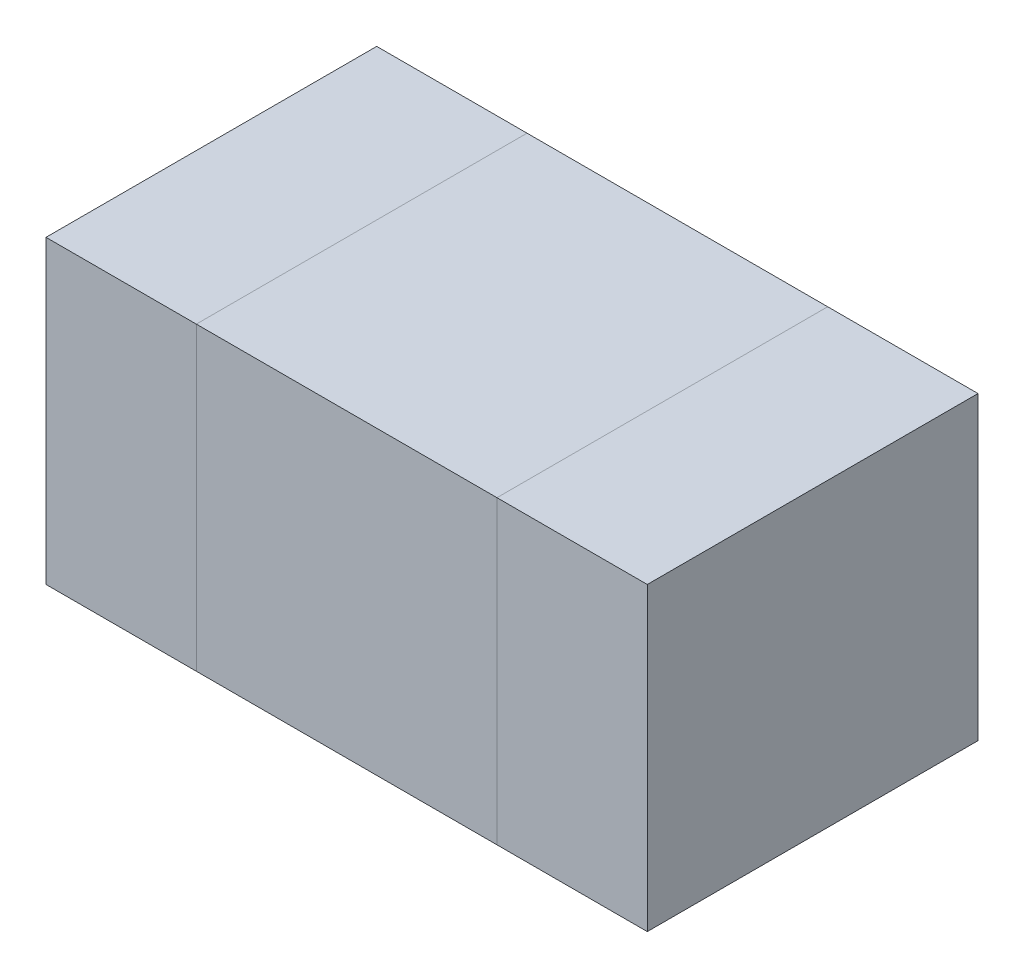
ISO-10303-21;
HEADER;
FILE_DESCRIPTION(('STEP AP214'),'2;1');
FILE_NAME('part.step','',(''),(''),'','','');
FILE_SCHEMA(('AUTOMOTIVE_DESIGN { 1 0 10303 214 1 1 1 1 }'));
ENDSEC;
DATA;
#1=APPLICATION_CONTEXT('core data for automotive mechanical design processes');
#2=APPLICATION_PROTOCOL_DEFINITION('international standard','automotive_design',2000,#1);
#3=PRODUCT_CONTEXT('',#1,'mechanical');
#4=PRODUCT('Part','Part','',(#3));
#5=PRODUCT_RELATED_PRODUCT_CATEGORY('part','',(#4));
#6=PRODUCT_DEFINITION_FORMATION('','',#4);
#7=PRODUCT_DEFINITION_CONTEXT('part definition',#1,'design');
#8=PRODUCT_DEFINITION('design','',#6,#7);
#9=PRODUCT_DEFINITION_SHAPE('','',#8);
#10=(LENGTH_UNIT() NAMED_UNIT(*) SI_UNIT(.MILLI.,.METRE.));
#11=(NAMED_UNIT(*) PLANE_ANGLE_UNIT() SI_UNIT($,.RADIAN.));
#12=(NAMED_UNIT(*) SI_UNIT($,.STERADIAN.) SOLID_ANGLE_UNIT());
#13=UNCERTAINTY_MEASURE_WITH_UNIT(LENGTH_MEASURE(1.E-05),#10,'distance_accuracy_value','');
#14=(GEOMETRIC_REPRESENTATION_CONTEXT(3) GLOBAL_UNCERTAINTY_ASSIGNED_CONTEXT((#13)) GLOBAL_UNIT_ASSIGNED_CONTEXT((#10,
#11,#12)) REPRESENTATION_CONTEXT('',''));
#15=CARTESIAN_POINT('',(0.,0.,0.));
#16=DIRECTION('',(0.,0.,1.));
#17=DIRECTION('',(1.,0.,0.));
#18=AXIS2_PLACEMENT_3D('',#15,#16,#17);
#19=CARTESIAN_POINT('',(-0.25,0.,0.));
#20=DIRECTION('',(-1.,0.,0.));
#21=DIRECTION('',(0.,0.,1.));
#22=AXIS2_PLACEMENT_3D('',#19,#20,#21);
#23=PLANE('',#22);
#24=DIRECTION('',(0.,0.,-1.));
#25=VECTOR('',#24,1.);
#26=CARTESIAN_POINT('',(-0.25,0.25,0.55));
#27=LINE('',#26,#25);
#28=CARTESIAN_POINT('',(-0.25,0.25,0.55));
#29=VERTEX_POINT('',#28);
#30=CARTESIAN_POINT('',(-0.25,0.25,0.));
#31=VERTEX_POINT('',#30);
#32=EDGE_CURVE('P0_E55',#29,#31,#27,.T.);
#33=ORIENTED_EDGE('',*,*,#32,.T.);
#34=DIRECTION('',(0.,1.,0.));
#35=VECTOR('',#34,1.);
#36=CARTESIAN_POINT('',(-0.25,0.,0.));
#37=LINE('',#36,#35);
#38=CARTESIAN_POINT('',(-0.25,-0.25,0.));
#39=VERTEX_POINT('',#38);
#40=EDGE_CURVE('P0_E67',#39,#31,#37,.T.);
#41=ORIENTED_EDGE('',*,*,#40,.F.);
#42=DIRECTION('',(0.,0.,1.));
#43=VECTOR('',#42,1.);
#44=CARTESIAN_POINT('',(-0.25,-0.25,0.55));
#45=LINE('',#44,#43);
#46=CARTESIAN_POINT('',(-0.25,-0.25,0.55));
#47=VERTEX_POINT('',#46);
#48=EDGE_CURVE('P0_E20',#39,#47,#45,.T.);
#49=ORIENTED_EDGE('',*,*,#48,.T.);
#50=DIRECTION('',(0.,1.,0.));
#51=VECTOR('',#50,1.);
#52=CARTESIAN_POINT('',(-0.25,0.,0.55));
#53=LINE('',#52,#51);
#54=EDGE_CURVE('P0_E80',#47,#29,#53,.T.);
#55=ORIENTED_EDGE('',*,*,#54,.T.);
#56=EDGE_LOOP('',(#33,#41,#49,#55));
#57=FACE_BOUND('',#56,.T.);
#58=ADVANCED_FACE('P0_F17',(#57),#23,.T.);
#59=CARTESIAN_POINT('',(0.5,-0.25,0.55));
#60=DIRECTION('',(0.,1.,0.));
#61=DIRECTION('',(0.,0.,1.));
#62=AXIS2_PLACEMENT_3D('',#59,#60,#61);
#63=PLANE('',#62);
#64=DIRECTION('',(-1.,0.,0.));
#65=VECTOR('',#64,1.);
#66=CARTESIAN_POINT('',(0.,-0.25,0.55));
#67=LINE('',#66,#65);
#68=CARTESIAN_POINT('',(0.25,-0.25,0.55));
#69=VERTEX_POINT('',#68);
#70=EDGE_CURVE('P0_E65',#69,#47,#67,.T.);
#71=ORIENTED_EDGE('',*,*,#70,.T.);
#72=ORIENTED_EDGE('',*,*,#48,.F.);
#73=DIRECTION('',(-1.,0.,0.));
#74=VECTOR('',#73,1.);
#75=CARTESIAN_POINT('',(0.,-0.25,0.));
#76=LINE('',#75,#74);
#77=CARTESIAN_POINT('',(0.25,-0.25,0.));
#78=VERTEX_POINT('',#77);
#79=EDGE_CURVE('P0_E62',#78,#39,#76,.T.);
#80=ORIENTED_EDGE('',*,*,#79,.F.);
#81=DIRECTION('',(0.,0.,-1.));
#82=VECTOR('',#81,1.);
#83=CARTESIAN_POINT('',(0.25,-0.25,0.));
#84=LINE('',#83,#82);
#85=EDGE_CURVE('P0_E83',#69,#78,#84,.T.);
#86=ORIENTED_EDGE('',*,*,#85,.F.);
#87=EDGE_LOOP('',(#71,#72,#80,#86));
#88=FACE_BOUND('',#87,.T.);
#89=ADVANCED_FACE('P0_F60',(#88),#63,.F.);
#90=CARTESIAN_POINT('',(0.,0.,0.));
#91=DIRECTION('',(0.,0.,-1.));
#92=DIRECTION('',(-1.,0.,0.));
#93=AXIS2_PLACEMENT_3D('',#90,#91,#92);
#94=PLANE('',#93);
#95=ORIENTED_EDGE('',*,*,#40,.T.);
#96=DIRECTION('',(1.,0.,0.));
#97=VECTOR('',#96,1.);
#98=CARTESIAN_POINT('',(-0.5,0.25,0.));
#99=LINE('',#98,#97);
#100=CARTESIAN_POINT('',(0.25,0.25,0.));
#101=VERTEX_POINT('',#100);
#102=EDGE_CURVE('P0_E77',#31,#101,#99,.T.);
#103=ORIENTED_EDGE('',*,*,#102,.T.);
#104=DIRECTION('',(0.,1.,0.));
#105=VECTOR('',#104,1.);
#106=CARTESIAN_POINT('',(0.25,0.,0.));
#107=LINE('',#106,#105);
#108=EDGE_CURVE('P0_E73',#78,#101,#107,.T.);
#109=ORIENTED_EDGE('',*,*,#108,.F.);
#110=ORIENTED_EDGE('',*,*,#79,.T.);
#111=EDGE_LOOP('',(#95,#103,#109,#110));
#112=FACE_BOUND('',#111,.T.);
#113=ADVANCED_FACE('P0_F71',(#112),#94,.T.);
#114=CARTESIAN_POINT('',(-0.5,0.25,0.55));
#115=DIRECTION('',(0.,-1.,0.));
#116=DIRECTION('',(0.,0.,-1.));
#117=AXIS2_PLACEMENT_3D('',#114,#115,#116);
#118=PLANE('',#117);
#119=ORIENTED_EDGE('',*,*,#102,.F.);
#120=ORIENTED_EDGE('',*,*,#32,.F.);
#121=DIRECTION('',(-1.,0.,0.));
#122=VECTOR('',#121,1.);
#123=CARTESIAN_POINT('',(0.,0.25,0.55));
#124=LINE('',#123,#122);
#125=CARTESIAN_POINT('',(0.25,0.25,0.55));
#126=VERTEX_POINT('',#125);
#127=EDGE_CURVE('P0_E35',#29,#126,#124,.F.);
#128=ORIENTED_EDGE('',*,*,#127,.T.);
#129=DIRECTION('',(0.,0.,-1.));
#130=VECTOR('',#129,1.);
#131=CARTESIAN_POINT('',(0.25,0.25,0.));
#132=LINE('',#131,#130);
#133=EDGE_CURVE('P0_E26',#101,#126,#132,.F.);
#134=ORIENTED_EDGE('',*,*,#133,.F.);
#135=EDGE_LOOP('',(#119,#120,#128,#134));
#136=FACE_BOUND('',#135,.T.);
#137=ADVANCED_FACE('P0_F89',(#136),#118,.F.);
#138=CARTESIAN_POINT('',(0.,0.,0.55));
#139=DIRECTION('',(0.,0.,-1.));
#140=DIRECTION('',(-1.,0.,0.));
#141=AXIS2_PLACEMENT_3D('',#138,#139,#140);
#142=PLANE('',#141);
#143=ORIENTED_EDGE('',*,*,#127,.F.);
#144=ORIENTED_EDGE('',*,*,#54,.F.);
#145=ORIENTED_EDGE('',*,*,#70,.F.);
#146=DIRECTION('',(0.,1.,0.));
#147=VECTOR('',#146,1.);
#148=CARTESIAN_POINT('',(0.25,0.,0.55));
#149=LINE('',#148,#147);
#150=EDGE_CURVE('P0_E11',#126,#69,#149,.F.);
#151=ORIENTED_EDGE('',*,*,#150,.F.);
#152=EDGE_LOOP('',(#143,#144,#145,#151));
#153=FACE_BOUND('',#152,.T.);
#154=ADVANCED_FACE('P0_F91',(#153),#142,.F.);
#155=CARTESIAN_POINT('',(0.25,0.,0.));
#156=DIRECTION('',(1.,0.,0.));
#157=DIRECTION('',(0.,0.,-1.));
#158=AXIS2_PLACEMENT_3D('',#155,#156,#157);
#159=PLANE('',#158);
#160=ORIENTED_EDGE('',*,*,#133,.T.);
#161=ORIENTED_EDGE('',*,*,#150,.T.);
#162=ORIENTED_EDGE('',*,*,#85,.T.);
#163=ORIENTED_EDGE('',*,*,#108,.T.);
#164=EDGE_LOOP('',(#160,#161,#162,#163));
#165=FACE_BOUND('',#164,.T.);
#166=ADVANCED_FACE('P0_F88',(#165),#159,.T.);
#167=CLOSED_SHELL('',(#58,#89,#113,#137,#154,#166));
#168=MANIFOLD_SOLID_BREP('P0_B1',#167);
#169=CARTESIAN_POINT('',(0.25,0.,0.));
#170=DIRECTION('',(1.,0.,0.));
#171=DIRECTION('',(0.,0.,-1.));
#172=AXIS2_PLACEMENT_3D('',#169,#170,#171);
#173=PLANE('',#172);
#174=DIRECTION('',(0.,1.,0.));
#175=VECTOR('',#174,1.);
#176=CARTESIAN_POINT('',(0.25,0.,0.55));
#177=LINE('',#176,#175);
#178=CARTESIAN_POINT('',(0.25,-0.25,0.55));
#179=VERTEX_POINT('',#178);
#180=CARTESIAN_POINT('',(0.25,0.25,0.55));
#181=VERTEX_POINT('',#180);
#182=EDGE_CURVE('P1_E55',#179,#181,#177,.T.);
#183=ORIENTED_EDGE('',*,*,#182,.T.);
#184=DIRECTION('',(0.,0.,-1.));
#185=VECTOR('',#184,1.);
#186=CARTESIAN_POINT('',(0.25,0.25,0.55));
#187=LINE('',#186,#185);
#188=CARTESIAN_POINT('',(0.25,0.25,0.));
#189=VERTEX_POINT('',#188);
#190=EDGE_CURVE('P1_E76',#181,#189,#187,.T.);
#191=ORIENTED_EDGE('',*,*,#190,.T.);
#192=DIRECTION('',(0.,1.,0.));
#193=VECTOR('',#192,1.);
#194=CARTESIAN_POINT('',(0.25,0.,0.));
#195=LINE('',#194,#193);
#196=CARTESIAN_POINT('',(0.25,-0.25,0.));
#197=VERTEX_POINT('',#196);
#198=EDGE_CURVE('P1_E58',#197,#189,#195,.T.);
#199=ORIENTED_EDGE('',*,*,#198,.F.);
#200=DIRECTION('',(0.,0.,1.));
#201=VECTOR('',#200,1.);
#202=CARTESIAN_POINT('',(0.25,-0.25,0.55));
#203=LINE('',#202,#201);
#204=EDGE_CURVE('P1_E20',#197,#179,#203,.T.);
#205=ORIENTED_EDGE('',*,*,#204,.T.);
#206=EDGE_LOOP('',(#183,#191,#199,#205));
#207=FACE_BOUND('',#206,.T.);
#208=ADVANCED_FACE('P1_F17',(#207),#173,.F.);
#209=CARTESIAN_POINT('',(0.5,-0.25,0.55));
#210=DIRECTION('',(0.,1.,0.));
#211=DIRECTION('',(0.,0.,1.));
#212=AXIS2_PLACEMENT_3D('',#209,#210,#211);
#213=PLANE('',#212);
#214=ORIENTED_EDGE('',*,*,#204,.F.);
#215=DIRECTION('',(-1.,0.,0.));
#216=VECTOR('',#215,1.);
#217=CARTESIAN_POINT('',(0.,-0.25,0.));
#218=LINE('',#217,#216);
#219=CARTESIAN_POINT('',(0.5,-0.25,0.));
#220=VERTEX_POINT('',#219);
#221=EDGE_CURVE('P1_E78',#220,#197,#218,.T.);
#222=ORIENTED_EDGE('',*,*,#221,.F.);
#223=DIRECTION('',(0.,0.,1.));
#224=VECTOR('',#223,1.);
#225=CARTESIAN_POINT('',(0.5,-0.25,0.55));
#226=LINE('',#225,#224);
#227=CARTESIAN_POINT('',(0.5,-0.25,0.55));
#228=VERTEX_POINT('',#227);
#229=EDGE_CURVE('P1_E73',#220,#228,#226,.T.);
#230=ORIENTED_EDGE('',*,*,#229,.T.);
#231=DIRECTION('',(-1.,0.,0.));
#232=VECTOR('',#231,1.);
#233=CARTESIAN_POINT('',(0.,-0.25,0.55));
#234=LINE('',#233,#232);
#235=EDGE_CURVE('P1_E63',#228,#179,#234,.T.);
#236=ORIENTED_EDGE('',*,*,#235,.T.);
#237=EDGE_LOOP('',(#214,#222,#230,#236));
#238=FACE_BOUND('',#237,.T.);
#239=ADVANCED_FACE('P1_F72',(#238),#213,.F.);
#240=CARTESIAN_POINT('',(0.,0.,0.55));
#241=DIRECTION('',(0.,0.,-1.));
#242=DIRECTION('',(-1.,0.,0.));
#243=AXIS2_PLACEMENT_3D('',#240,#241,#242);
#244=PLANE('',#243);
#245=ORIENTED_EDGE('',*,*,#182,.F.);
#246=ORIENTED_EDGE('',*,*,#235,.F.);
#247=DIRECTION('',(0.,1.,0.));
#248=VECTOR('',#247,1.);
#249=CARTESIAN_POINT('',(0.5,0.25,0.55));
#250=LINE('',#249,#248);
#251=CARTESIAN_POINT('',(0.5,0.25,0.55));
#252=VERTEX_POINT('',#251);
#253=EDGE_CURVE('P1_E83',#228,#252,#250,.T.);
#254=ORIENTED_EDGE('',*,*,#253,.T.);
#255=DIRECTION('',(1.,0.,0.));
#256=VECTOR('',#255,1.);
#257=CARTESIAN_POINT('',(-0.5,0.25,0.55));
#258=LINE('',#257,#256);
#259=EDGE_CURVE('P1_E69',#252,#181,#258,.F.);
#260=ORIENTED_EDGE('',*,*,#259,.T.);
#261=EDGE_LOOP('',(#245,#246,#254,#260));
#262=FACE_BOUND('',#261,.T.);
#263=ADVANCED_FACE('P1_F66',(#262),#244,.F.);
#264=CARTESIAN_POINT('',(-0.5,0.25,0.55));
#265=DIRECTION('',(0.,-1.,0.));
#266=DIRECTION('',(0.,0.,-1.));
#267=AXIS2_PLACEMENT_3D('',#264,#265,#266);
#268=PLANE('',#267);
#269=ORIENTED_EDGE('',*,*,#190,.F.);
#270=ORIENTED_EDGE('',*,*,#259,.F.);
#271=DIRECTION('',(0.,0.,1.));
#272=VECTOR('',#271,1.);
#273=CARTESIAN_POINT('',(0.5,0.25,0.55));
#274=LINE('',#273,#272);
#275=CARTESIAN_POINT('',(0.5,0.25,0.));
#276=VERTEX_POINT('',#275);
#277=EDGE_CURVE('P1_E26',#252,#276,#274,.F.);
#278=ORIENTED_EDGE('',*,*,#277,.T.);
#279=DIRECTION('',(-1.,0.,0.));
#280=VECTOR('',#279,1.);
#281=CARTESIAN_POINT('',(0.,0.25,0.));
#282=LINE('',#281,#280);
#283=EDGE_CURVE('P1_E34',#189,#276,#282,.F.);
#284=ORIENTED_EDGE('',*,*,#283,.F.);
#285=EDGE_LOOP('',(#269,#270,#278,#284));
#286=FACE_BOUND('',#285,.T.);
#287=ADVANCED_FACE('P1_F88',(#286),#268,.F.);
#288=CARTESIAN_POINT('',(0.,0.,0.));
#289=DIRECTION('',(0.,0.,-1.));
#290=DIRECTION('',(-1.,0.,0.));
#291=AXIS2_PLACEMENT_3D('',#288,#289,#290);
#292=PLANE('',#291);
#293=ORIENTED_EDGE('',*,*,#283,.T.);
#294=DIRECTION('',(0.,1.,0.));
#295=VECTOR('',#294,1.);
#296=CARTESIAN_POINT('',(0.5,0.25,0.));
#297=LINE('',#296,#295);
#298=EDGE_CURVE('P1_E11',#276,#220,#297,.F.);
#299=ORIENTED_EDGE('',*,*,#298,.T.);
#300=ORIENTED_EDGE('',*,*,#221,.T.);
#301=ORIENTED_EDGE('',*,*,#198,.T.);
#302=EDGE_LOOP('',(#293,#299,#300,#301));
#303=FACE_BOUND('',#302,.T.);
#304=ADVANCED_FACE('P1_F91',(#303),#292,.T.);
#305=CARTESIAN_POINT('',(0.5,0.25,0.55));
#306=DIRECTION('',(-1.,0.,0.));
#307=DIRECTION('',(0.,0.,1.));
#308=AXIS2_PLACEMENT_3D('',#305,#306,#307);
#309=PLANE('',#308);
#310=ORIENTED_EDGE('',*,*,#277,.F.);
#311=ORIENTED_EDGE('',*,*,#253,.F.);
#312=ORIENTED_EDGE('',*,*,#229,.F.);
#313=ORIENTED_EDGE('',*,*,#298,.F.);
#314=EDGE_LOOP('',(#310,#311,#312,#313));
#315=FACE_BOUND('',#314,.T.);
#316=ADVANCED_FACE('P1_F90',(#315),#309,.F.);
#317=CLOSED_SHELL('',(#208,#239,#263,#287,#304,#316));
#318=MANIFOLD_SOLID_BREP('P1_B1',#317);
#319=CARTESIAN_POINT('',(-0.5,-0.25,0.55));
#320=DIRECTION('',(1.,0.,0.));
#321=DIRECTION('',(0.,0.,-1.));
#322=AXIS2_PLACEMENT_3D('',#319,#320,#321);
#323=PLANE('',#322);
#324=DIRECTION('',(0.,0.,1.));
#325=VECTOR('',#324,1.);
#326=CARTESIAN_POINT('',(-0.5,-0.25,0.55));
#327=LINE('',#326,#325);
#328=CARTESIAN_POINT('',(-0.5,-0.25,0.));
#329=VERTEX_POINT('',#328);
#330=CARTESIAN_POINT('',(-0.5,-0.25,0.55));
#331=VERTEX_POINT('',#330);
#332=EDGE_CURVE('P2_E61',#329,#331,#327,.T.);
#333=ORIENTED_EDGE('',*,*,#332,.T.);
#334=DIRECTION('',(0.,1.,0.));
#335=VECTOR('',#334,1.);
#336=CARTESIAN_POINT('',(-0.5,0.,0.55));
#337=LINE('',#336,#335);
#338=CARTESIAN_POINT('',(-0.5,0.25,0.55));
#339=VERTEX_POINT('',#338);
#340=EDGE_CURVE('P2_E20',#331,#339,#337,.T.);
#341=ORIENTED_EDGE('',*,*,#340,.T.);
#342=DIRECTION('',(0.,0.,-1.));
#343=VECTOR('',#342,1.);
#344=CARTESIAN_POINT('',(-0.5,0.25,0.55));
#345=LINE('',#344,#343);
#346=CARTESIAN_POINT('',(-0.5,0.25,0.));
#347=VERTEX_POINT('',#346);
#348=EDGE_CURVE('P2_E59',#339,#347,#345,.T.);
#349=ORIENTED_EDGE('',*,*,#348,.T.);
#350=DIRECTION('',(0.,1.,0.));
#351=VECTOR('',#350,1.);
#352=CARTESIAN_POINT('',(-0.5,0.,0.));
#353=LINE('',#352,#351);
#354=EDGE_CURVE('P2_E53',#329,#347,#353,.T.);
#355=ORIENTED_EDGE('',*,*,#354,.F.);
#356=EDGE_LOOP('',(#333,#341,#349,#355));
#357=FACE_BOUND('',#356,.T.);
#358=ADVANCED_FACE('P2_F17',(#357),#323,.F.);
#359=CARTESIAN_POINT('',(0.,0.,0.55));
#360=DIRECTION('',(0.,0.,-1.));
#361=DIRECTION('',(-1.,0.,0.));
#362=AXIS2_PLACEMENT_3D('',#359,#360,#361);
#363=PLANE('',#362);
#364=DIRECTION('',(1.,0.,0.));
#365=VECTOR('',#364,1.);
#366=CARTESIAN_POINT('',(-0.5,0.25,0.55));
#367=LINE('',#366,#365);
#368=CARTESIAN_POINT('',(-0.25,0.25,0.55));
#369=VERTEX_POINT('',#368);
#370=EDGE_CURVE('P2_E66',#369,#339,#367,.F.);
#371=ORIENTED_EDGE('',*,*,#370,.T.);
#372=ORIENTED_EDGE('',*,*,#340,.F.);
#373=DIRECTION('',(1.,0.,0.));
#374=VECTOR('',#373,1.);
#375=CARTESIAN_POINT('',(0.5,-0.25,0.55));
#376=LINE('',#375,#374);
#377=CARTESIAN_POINT('',(-0.25,-0.25,0.55));
#378=VERTEX_POINT('',#377);
#379=EDGE_CURVE('P2_E81',#331,#378,#376,.T.);
#380=ORIENTED_EDGE('',*,*,#379,.T.);
#381=DIRECTION('',(0.,1.,0.));
#382=VECTOR('',#381,1.);
#383=CARTESIAN_POINT('',(-0.25,0.,0.55));
#384=LINE('',#383,#382);
#385=EDGE_CURVE('P2_E75',#378,#369,#384,.T.);
#386=ORIENTED_EDGE('',*,*,#385,.T.);
#387=EDGE_LOOP('',(#371,#372,#380,#386));
#388=FACE_BOUND('',#387,.T.);
#389=ADVANCED_FACE('P2_F74',(#388),#363,.F.);
#390=CARTESIAN_POINT('',(-0.5,0.25,0.55));
#391=DIRECTION('',(0.,-1.,0.));
#392=DIRECTION('',(0.,0.,-1.));
#393=AXIS2_PLACEMENT_3D('',#390,#391,#392);
#394=PLANE('',#393);
#395=DIRECTION('',(-1.,0.,0.));
#396=VECTOR('',#395,1.);
#397=CARTESIAN_POINT('',(0.,0.25,0.));
#398=LINE('',#397,#396);
#399=CARTESIAN_POINT('',(-0.25,0.25,0.));
#400=VERTEX_POINT('',#399);
#401=EDGE_CURVE('P2_E71',#347,#400,#398,.F.);
#402=ORIENTED_EDGE('',*,*,#401,.F.);
#403=ORIENTED_EDGE('',*,*,#348,.F.);
#404=ORIENTED_EDGE('',*,*,#370,.F.);
#405=DIRECTION('',(0.,0.,1.));
#406=VECTOR('',#405,1.);
#407=CARTESIAN_POINT('',(-0.25,0.25,0.));
#408=LINE('',#407,#406);
#409=EDGE_CURVE('P2_E84',#369,#400,#408,.F.);
#410=ORIENTED_EDGE('',*,*,#409,.T.);
#411=EDGE_LOOP('',(#402,#403,#404,#410));
#412=FACE_BOUND('',#411,.T.);
#413=ADVANCED_FACE('P2_F68',(#412),#394,.F.);
#414=CARTESIAN_POINT('',(0.,0.,0.));
#415=DIRECTION('',(0.,0.,-1.));
#416=DIRECTION('',(-1.,0.,0.));
#417=AXIS2_PLACEMENT_3D('',#414,#415,#416);
#418=PLANE('',#417);
#419=ORIENTED_EDGE('',*,*,#354,.T.);
#420=ORIENTED_EDGE('',*,*,#401,.T.);
#421=DIRECTION('',(0.,1.,0.));
#422=VECTOR('',#421,1.);
#423=CARTESIAN_POINT('',(-0.25,0.,0.));
#424=LINE('',#423,#422);
#425=CARTESIAN_POINT('',(-0.25,-0.25,0.));
#426=VERTEX_POINT('',#425);
#427=EDGE_CURVE('P2_E26',#400,#426,#424,.F.);
#428=ORIENTED_EDGE('',*,*,#427,.T.);
#429=DIRECTION('',(1.,0.,0.));
#430=VECTOR('',#429,1.);
#431=CARTESIAN_POINT('',(0.5,-0.25,0.));
#432=LINE('',#431,#430);
#433=EDGE_CURVE('P2_E34',#426,#329,#432,.F.);
#434=ORIENTED_EDGE('',*,*,#433,.T.);
#435=EDGE_LOOP('',(#419,#420,#428,#434));
#436=FACE_BOUND('',#435,.T.);
#437=ADVANCED_FACE('P2_F88',(#436),#418,.T.);
#438=CARTESIAN_POINT('',(0.5,-0.25,0.55));
#439=DIRECTION('',(0.,1.,0.));
#440=DIRECTION('',(0.,0.,1.));
#441=AXIS2_PLACEMENT_3D('',#438,#439,#440);
#442=PLANE('',#441);
#443=ORIENTED_EDGE('',*,*,#379,.F.);
#444=ORIENTED_EDGE('',*,*,#332,.F.);
#445=ORIENTED_EDGE('',*,*,#433,.F.);
#446=DIRECTION('',(0.,0.,1.));
#447=VECTOR('',#446,1.);
#448=CARTESIAN_POINT('',(-0.25,-0.25,0.));
#449=LINE('',#448,#447);
#450=EDGE_CURVE('P2_E11',#426,#378,#449,.T.);
#451=ORIENTED_EDGE('',*,*,#450,.T.);
#452=EDGE_LOOP('',(#443,#444,#445,#451));
#453=FACE_BOUND('',#452,.T.);
#454=ADVANCED_FACE('P2_F91',(#453),#442,.F.);
#455=CARTESIAN_POINT('',(-0.25,0.,0.));
#456=DIRECTION('',(-1.,0.,0.));
#457=DIRECTION('',(0.,0.,1.));
#458=AXIS2_PLACEMENT_3D('',#455,#456,#457);
#459=PLANE('',#458);
#460=ORIENTED_EDGE('',*,*,#427,.F.);
#461=ORIENTED_EDGE('',*,*,#409,.F.);
#462=ORIENTED_EDGE('',*,*,#385,.F.);
#463=ORIENTED_EDGE('',*,*,#450,.F.);
#464=EDGE_LOOP('',(#460,#461,#462,#463));
#465=FACE_BOUND('',#464,.T.);
#466=ADVANCED_FACE('P2_F90',(#465),#459,.F.);
#467=CLOSED_SHELL('',(#358,#389,#413,#437,#454,#466));
#468=MANIFOLD_SOLID_BREP('P2_B1',#467);
#469=ADVANCED_BREP_SHAPE_REPRESENTATION('',(#18,#168,#318,#468),#14);
#470=SHAPE_DEFINITION_REPRESENTATION(#9,#469);
ENDSEC;
END-ISO-10303-21;
